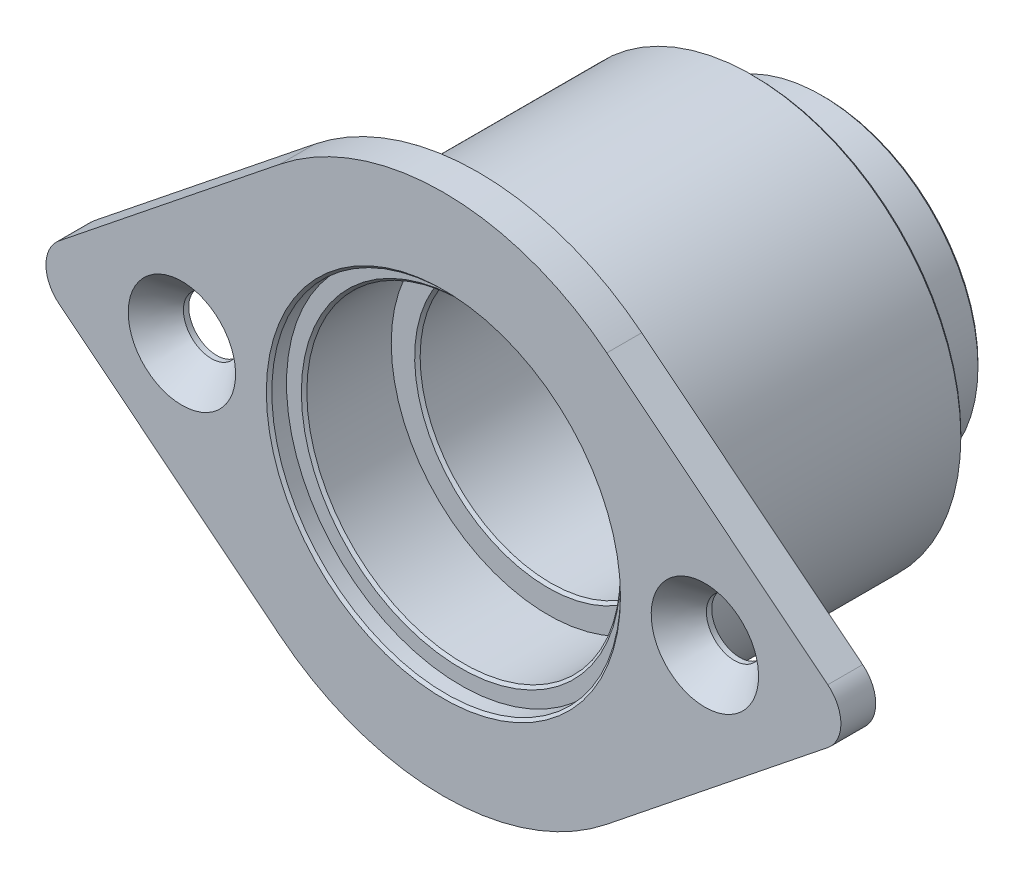
ISO-10303-21;
HEADER;
FILE_DESCRIPTION(('STEP AP214'),'2;1');
FILE_NAME('part.step','',(''),(''),'','','');
FILE_SCHEMA(('AUTOMOTIVE_DESIGN { 1 0 10303 214 1 1 1 1 }'));
ENDSEC;
DATA;
#1=APPLICATION_CONTEXT('core data for automotive mechanical design processes');
#2=APPLICATION_PROTOCOL_DEFINITION('international standard','automotive_design',2000,#1);
#3=PRODUCT_CONTEXT('',#1,'mechanical');
#4=PRODUCT('Part','Part','',(#3));
#5=PRODUCT_RELATED_PRODUCT_CATEGORY('part','',(#4));
#6=PRODUCT_DEFINITION_FORMATION('','',#4);
#7=PRODUCT_DEFINITION_CONTEXT('part definition',#1,'design');
#8=PRODUCT_DEFINITION('design','',#6,#7);
#9=PRODUCT_DEFINITION_SHAPE('','',#8);
#10=(LENGTH_UNIT() NAMED_UNIT(*) SI_UNIT(.MILLI.,.METRE.));
#11=(NAMED_UNIT(*) PLANE_ANGLE_UNIT() SI_UNIT($,.RADIAN.));
#12=(NAMED_UNIT(*) SI_UNIT($,.STERADIAN.) SOLID_ANGLE_UNIT());
#13=UNCERTAINTY_MEASURE_WITH_UNIT(LENGTH_MEASURE(1.E-05),#10,'distance_accuracy_value','');
#14=(GEOMETRIC_REPRESENTATION_CONTEXT(3) GLOBAL_UNCERTAINTY_ASSIGNED_CONTEXT((#13)) GLOBAL_UNIT_ASSIGNED_CONTEXT((#10,
#11,#12)) REPRESENTATION_CONTEXT('',''));
#15=CARTESIAN_POINT('',(0.,0.,0.));
#16=DIRECTION('',(0.,0.,1.));
#17=DIRECTION('',(1.,0.,0.));
#18=AXIS2_PLACEMENT_3D('',#15,#16,#17);
#19=CARTESIAN_POINT('',(0.,0.,-7.9375));
#20=DIRECTION('',(0.,0.,1.));
#21=DIRECTION('',(1.,0.,0.));
#22=AXIS2_PLACEMENT_3D('',#19,#20,#21);
#23=PLANE('',#22);
#24=CARTESIAN_POINT('',(0.,0.,-7.9375));
#25=DIRECTION('',(0.,0.,-1.));
#26=DIRECTION('',(-1.,0.,0.));
#27=AXIS2_PLACEMENT_3D('',#24,#25,#26);
#28=CIRCLE('',#27,14.2748);
#29=CARTESIAN_POINT('',(-14.2748,0.,-7.9375));
#30=VERTEX_POINT('',#29);
#31=EDGE_CURVE('E137',#30,#30,#28,.F.);
#32=ORIENTED_EDGE('',*,*,#31,.T.);
#33=EDGE_LOOP('',(#32));
#34=FACE_BOUND('',#33,.T.);
#35=CARTESIAN_POINT('',(0.,0.,-7.9375));
#36=DIRECTION('',(0.,0.,1.));
#37=DIRECTION('',(0.,-1.,0.));
#38=AXIS2_PLACEMENT_3D('',#35,#36,#37);
#39=CIRCLE('',#38,12.1435499999999);
#40=CARTESIAN_POINT('',(0.,-12.1435499999999,-7.9375));
#41=VERTEX_POINT('',#40);
#42=EDGE_CURVE('E21',#41,#41,#39,.F.);
#43=ORIENTED_EDGE('',*,*,#42,.T.);
#44=EDGE_LOOP('',(#43));
#45=FACE_BOUND('',#44,.T.);
#46=ADVANCED_FACE('F18',(#34,#45),#23,.T.);
#47=CARTESIAN_POINT('',(0.,0.,-7.9375));
#48=DIRECTION('',(0.,0.,1.));
#49=DIRECTION('',(0.,-1.,0.));
#50=AXIS2_PLACEMENT_3D('',#47,#48,#49);
#51=CONICAL_SURFACE('',#50,12.1435499999999,0.785398163397434);
#52=CARTESIAN_POINT('',(0.,0.,-8.18749999999995));
#53=DIRECTION('',(0.,0.,-1.));
#54=DIRECTION('',(-1.,0.,0.));
#55=AXIS2_PLACEMENT_3D('',#52,#53,#54);
#56=CIRCLE('',#55,11.89355);
#57=CARTESIAN_POINT('',(-11.89355,0.,-8.18749999999995));
#58=VERTEX_POINT('',#57);
#59=EDGE_CURVE('E135',#58,#58,#56,.T.);
#60=ORIENTED_EDGE('',*,*,#59,.T.);
#61=EDGE_LOOP('',(#60));
#62=FACE_BOUND('',#61,.T.);
#63=ORIENTED_EDGE('',*,*,#42,.F.);
#64=EDGE_LOOP('',(#63));
#65=FACE_BOUND('',#64,.T.);
#66=ADVANCED_FACE('F196',(#62,#65),#51,.F.);
#67=CARTESIAN_POINT('',(0.,0.,1.5875));
#68=DIRECTION('',(0.,0.,-1.));
#69=DIRECTION('',(-1.,0.,0.));
#70=AXIS2_PLACEMENT_3D('',#67,#68,#69);
#71=CYLINDRICAL_SURFACE('',#70,14.2748);
#72=CARTESIAN_POINT('',(0.,0.,-0.249999999999985));
#73=DIRECTION('',(0.,0.,1.));
#74=DIRECTION('',(1.,0.,0.));
#75=AXIS2_PLACEMENT_3D('',#72,#73,#74);
#76=CIRCLE('',#75,14.2748);
#77=CARTESIAN_POINT('',(14.2748,0.,-0.249999999999985));
#78=VERTEX_POINT('',#77);
#79=EDGE_CURVE('E132',#78,#78,#76,.T.);
#80=ORIENTED_EDGE('',*,*,#79,.T.);
#81=EDGE_LOOP('',(#80));
#82=FACE_BOUND('',#81,.T.);
#83=ORIENTED_EDGE('',*,*,#31,.F.);
#84=EDGE_LOOP('',(#83));
#85=FACE_BOUND('',#84,.T.);
#86=ADVANCED_FACE('F198',(#82,#85),#71,.F.);
#87=CARTESIAN_POINT('',(0.,0.,38.7877315203269));
#88=DIRECTION('',(0.,0.,-1.));
#89=DIRECTION('',(-1.,0.,0.));
#90=AXIS2_PLACEMENT_3D('',#87,#88,#89);
#91=CYLINDRICAL_SURFACE('',#90,11.89355);
#92=ORIENTED_EDGE('',*,*,#59,.F.);
#93=EDGE_LOOP('',(#92));
#94=FACE_BOUND('',#93,.T.);
#95=CARTESIAN_POINT('',(0.,0.,-32.8334999999999));
#96=DIRECTION('',(0.,0.,-1.));
#97=DIRECTION('',(-1.,0.,0.));
#98=AXIS2_PLACEMENT_3D('',#95,#96,#97);
#99=CIRCLE('',#98,11.89355);
#100=CARTESIAN_POINT('',(-11.89355,0.,-32.8334999999999));
#101=VERTEX_POINT('',#100);
#102=EDGE_CURVE('E128',#101,#101,#99,.T.);
#103=ORIENTED_EDGE('',*,*,#102,.T.);
#104=EDGE_LOOP('',(#103));
#105=FACE_BOUND('',#104,.T.);
#106=ADVANCED_FACE('F205',(#94,#105),#91,.F.);
#107=CARTESIAN_POINT('',(0.,0.,0.));
#108=DIRECTION('',(0.,0.,1.));
#109=DIRECTION('',(1.,0.,0.));
#110=AXIS2_PLACEMENT_3D('',#107,#108,#109);
#111=CONICAL_SURFACE('',#110,14.5248,0.785398163397459);
#112=ORIENTED_EDGE('',*,*,#79,.F.);
#113=EDGE_LOOP('',(#112));
#114=FACE_BOUND('',#113,.T.);
#115=CARTESIAN_POINT('',(0.,0.,0.));
#116=DIRECTION('',(0.,0.,1.));
#117=DIRECTION('',(1.,0.,0.));
#118=AXIS2_PLACEMENT_3D('',#115,#116,#117);
#119=CIRCLE('',#118,14.5248);
#120=CARTESIAN_POINT('',(14.5248,0.,0.));
#121=VERTEX_POINT('',#120);
#122=EDGE_CURVE('E131',#121,#121,#119,.F.);
#123=ORIENTED_EDGE('',*,*,#122,.F.);
#124=EDGE_LOOP('',(#123));
#125=FACE_BOUND('',#124,.T.);
#126=ADVANCED_FACE('F301',(#114,#125),#111,.F.);
#127=CARTESIAN_POINT('',(0.,0.,-33.0835));
#128=DIRECTION('',(0.,0.,-1.));
#129=DIRECTION('',(0.,1.,0.));
#130=AXIS2_PLACEMENT_3D('',#127,#128,#129);
#131=CONICAL_SURFACE('',#130,12.1435500000001,0.785398163397448);
#132=ORIENTED_EDGE('',*,*,#102,.F.);
#133=EDGE_LOOP('',(#132));
#134=FACE_BOUND('',#133,.T.);
#135=CARTESIAN_POINT('',(0.,0.,-33.0835));
#136=DIRECTION('',(0.,0.,-1.));
#137=DIRECTION('',(0.,1.,0.));
#138=AXIS2_PLACEMENT_3D('',#135,#136,#137);
#139=CIRCLE('',#138,12.1435500000001);
#140=CARTESIAN_POINT('',(0.,12.1435500000001,-33.0835));
#141=VERTEX_POINT('',#140);
#142=EDGE_CURVE('E185',#141,#141,#139,.F.);
#143=ORIENTED_EDGE('',*,*,#142,.F.);
#144=EDGE_LOOP('',(#143));
#145=FACE_BOUND('',#144,.T.);
#146=ADVANCED_FACE('F297',(#134,#145),#131,.F.);
#147=CARTESIAN_POINT('',(0.,0.,0.));
#148=DIRECTION('',(0.,0.,1.));
#149=DIRECTION('',(1.,0.,0.));
#150=AXIS2_PLACEMENT_3D('',#147,#148,#149);
#151=PLANE('',#150);
#152=CARTESIAN_POINT('',(0.,0.,0.));
#153=DIRECTION('',(0.,0.,1.));
#154=DIRECTION('',(1.,0.,0.));
#155=AXIS2_PLACEMENT_3D('',#152,#153,#154);
#156=CIRCLE('',#155,15.875);
#157=CARTESIAN_POINT('',(15.875,0.,0.));
#158=VERTEX_POINT('',#157);
#159=EDGE_CURVE('E182',#158,#158,#156,.T.);
#160=ORIENTED_EDGE('',*,*,#159,.T.);
#161=EDGE_LOOP('',(#160));
#162=FACE_BOUND('',#161,.T.);
#163=ORIENTED_EDGE('',*,*,#122,.T.);
#164=EDGE_LOOP('',(#163));
#165=FACE_BOUND('',#164,.T.);
#166=ADVANCED_FACE('F293',(#162,#165),#151,.T.);
#167=CARTESIAN_POINT('',(0.,0.,-33.0835));
#168=DIRECTION('',(0.,0.,-1.));
#169=DIRECTION('',(-1.,0.,0.));
#170=AXIS2_PLACEMENT_3D('',#167,#168,#169);
#171=PLANE('',#170);
#172=ORIENTED_EDGE('',*,*,#142,.T.);
#173=EDGE_LOOP('',(#172));
#174=FACE_BOUND('',#173,.T.);
#175=CARTESIAN_POINT('',(0.,0.,-33.0835));
#176=DIRECTION('',(0.,0.,1.));
#177=DIRECTION('',(1.,0.,0.));
#178=AXIS2_PLACEMENT_3D('',#175,#176,#177);
#179=CIRCLE('',#178,14.0121);
#180=CARTESIAN_POINT('',(14.0121,0.,-33.0835));
#181=VERTEX_POINT('',#180);
#182=EDGE_CURVE('E127',#181,#181,#179,.T.);
#183=ORIENTED_EDGE('',*,*,#182,.F.);
#184=EDGE_LOOP('',(#183));
#185=FACE_BOUND('',#184,.T.);
#186=ADVANCED_FACE('F289',(#174,#185),#171,.T.);
#187=CARTESIAN_POINT('',(0.,0.,0.));
#188=DIRECTION('',(0.,0.,1.));
#189=DIRECTION('',(1.,0.,0.));
#190=AXIS2_PLACEMENT_3D('',#187,#188,#189);
#191=CYLINDRICAL_SURFACE('',#190,15.875);
#192=ORIENTED_EDGE('',*,*,#159,.F.);
#193=EDGE_LOOP('',(#192));
#194=FACE_BOUND('',#193,.T.);
#195=CARTESIAN_POINT('',(0.,0.,1.3375));
#196=DIRECTION('',(0.,0.,1.));
#197=DIRECTION('',(1.,0.,0.));
#198=AXIS2_PLACEMENT_3D('',#195,#196,#197);
#199=CIRCLE('',#198,15.875);
#200=CARTESIAN_POINT('',(15.875,0.,1.3375));
#201=VERTEX_POINT('',#200);
#202=EDGE_CURVE('E124',#201,#201,#199,.T.);
#203=ORIENTED_EDGE('',*,*,#202,.T.);
#204=EDGE_LOOP('',(#203));
#205=FACE_BOUND('',#204,.T.);
#206=ADVANCED_FACE('F285',(#194,#205),#191,.F.);
#207=CARTESIAN_POINT('',(0.,0.,-32.8335));
#208=DIRECTION('',(0.,0.,1.));
#209=DIRECTION('',(1.,0.,0.));
#210=AXIS2_PLACEMENT_3D('',#207,#208,#209);
#211=CONICAL_SURFACE('',#210,14.2621,0.785398163397424);
#212=CARTESIAN_POINT('',(0.,0.,-32.8335));
#213=DIRECTION('',(0.,0.,-1.));
#214=DIRECTION('',(-1.,0.,0.));
#215=AXIS2_PLACEMENT_3D('',#212,#213,#214);
#216=CIRCLE('',#215,14.2621);
#217=CARTESIAN_POINT('',(-14.2621,0.,-32.8335));
#218=VERTEX_POINT('',#217);
#219=EDGE_CURVE('E120',#218,#218,#216,.F.);
#220=ORIENTED_EDGE('',*,*,#219,.F.);
#221=EDGE_LOOP('',(#220));
#222=FACE_BOUND('',#221,.T.);
#223=ORIENTED_EDGE('',*,*,#182,.T.);
#224=EDGE_LOOP('',(#223));
#225=FACE_BOUND('',#224,.T.);
#226=ADVANCED_FACE('F281',(#222,#225),#211,.T.);
#227=CARTESIAN_POINT('',(0.,0.,1.5875));
#228=DIRECTION('',(0.,0.,1.));
#229=DIRECTION('',(1.,0.,0.));
#230=AXIS2_PLACEMENT_3D('',#227,#228,#229);
#231=CONICAL_SURFACE('',#230,16.125,0.785398163397476);
#232=ORIENTED_EDGE('',*,*,#202,.F.);
#233=EDGE_LOOP('',(#232));
#234=FACE_BOUND('',#233,.T.);
#235=CARTESIAN_POINT('',(0.,0.,1.5875));
#236=DIRECTION('',(0.,0.,1.));
#237=DIRECTION('',(1.,0.,0.));
#238=AXIS2_PLACEMENT_3D('',#235,#236,#237);
#239=CIRCLE('',#238,16.125);
#240=CARTESIAN_POINT('',(16.125,0.,1.5875));
#241=VERTEX_POINT('',#240);
#242=EDGE_CURVE('E123',#241,#241,#239,.F.);
#243=ORIENTED_EDGE('',*,*,#242,.F.);
#244=EDGE_LOOP('',(#243));
#245=FACE_BOUND('',#244,.T.);
#246=ADVANCED_FACE('F277',(#234,#245),#231,.F.);
#247=CARTESIAN_POINT('',(0.,0.,27.1480367264149));
#248=DIRECTION('',(0.,0.,-1.));
#249=DIRECTION('',(-1.,0.,0.));
#250=AXIS2_PLACEMENT_3D('',#247,#248,#249);
#251=CYLINDRICAL_SURFACE('',#250,14.2621);
#252=ORIENTED_EDGE('',*,*,#219,.T.);
#253=EDGE_LOOP('',(#252));
#254=FACE_BOUND('',#253,.T.);
#255=CARTESIAN_POINT('',(0.,0.,-26.7335));
#256=DIRECTION('',(0.,0.,-1.));
#257=DIRECTION('',(-1.,0.,0.));
#258=AXIS2_PLACEMENT_3D('',#255,#256,#257);
#259=CIRCLE('',#258,14.2621);
#260=CARTESIAN_POINT('',(-14.2621,0.,-26.7335));
#261=VERTEX_POINT('',#260);
#262=EDGE_CURVE('E119',#261,#261,#259,.F.);
#263=ORIENTED_EDGE('',*,*,#262,.F.);
#264=EDGE_LOOP('',(#263));
#265=FACE_BOUND('',#264,.T.);
#266=ADVANCED_FACE('F273',(#254,#265),#251,.T.);
#267=CARTESIAN_POINT('',(-23.8125,0.,1.58749999997099));
#268=DIRECTION('',(0.,0.,1.));
#269=DIRECTION('',(0.,-1.,0.));
#270=AXIS2_PLACEMENT_3D('',#267,#268,#269);
#271=CONICAL_SURFACE('',#270,4.88949999997067,0.71558499333661);
#272=CARTESIAN_POINT('',(-23.8125,0.,-1.10068089399406));
#273=DIRECTION('',(0.,0.,1.));
#274=DIRECTION('',(1.,0.,0.));
#275=AXIS2_PLACEMENT_3D('',#272,#273,#274);
#276=CIRCLE('',#275,2.5527);
#277=CARTESIAN_POINT('',(-21.2598,0.,-1.10068089399406));
#278=VERTEX_POINT('',#277);
#279=EDGE_CURVE('E116',#278,#278,#276,.F.);
#280=ORIENTED_EDGE('',*,*,#279,.T.);
#281=EDGE_LOOP('',(#280));
#282=FACE_BOUND('',#281,.T.);
#283=CARTESIAN_POINT('',(-23.8125,0.,1.58749999997099));
#284=DIRECTION('',(0.,0.,1.));
#285=DIRECTION('',(0.,-1.,0.));
#286=AXIS2_PLACEMENT_3D('',#283,#284,#285);
#287=CIRCLE('',#286,4.88949999997067);
#288=CARTESIAN_POINT('',(-23.8125,-4.88949999997067,1.58749999997099));
#289=VERTEX_POINT('',#288);
#290=EDGE_CURVE('E175',#289,#289,#287,.F.);
#291=ORIENTED_EDGE('',*,*,#290,.F.);
#292=EDGE_LOOP('',(#291));
#293=FACE_BOUND('',#292,.T.);
#294=ADVANCED_FACE('F269',(#282,#293),#271,.F.);
#295=CARTESIAN_POINT('',(23.8125,0.,1.58749999997099));
#296=DIRECTION('',(0.,0.,1.));
#297=DIRECTION('',(0.,-1.,0.));
#298=AXIS2_PLACEMENT_3D('',#295,#296,#297);
#299=CONICAL_SURFACE('',#298,4.88949999995293,0.71558499333661);
#300=CARTESIAN_POINT('',(23.8125,0.,-1.10068089399406));
#301=DIRECTION('',(0.,0.,1.));
#302=DIRECTION('',(1.,0.,0.));
#303=AXIS2_PLACEMENT_3D('',#300,#301,#302);
#304=CIRCLE('',#303,2.5527);
#305=CARTESIAN_POINT('',(26.3652,0.,-1.10068089399406));
#306=VERTEX_POINT('',#305);
#307=EDGE_CURVE('E94',#306,#306,#304,.F.);
#308=ORIENTED_EDGE('',*,*,#307,.T.);
#309=EDGE_LOOP('',(#308));
#310=FACE_BOUND('',#309,.T.);
#311=CARTESIAN_POINT('',(23.8125,0.,1.58749999997099));
#312=DIRECTION('',(0.,0.,1.));
#313=DIRECTION('',(0.,-1.,0.));
#314=AXIS2_PLACEMENT_3D('',#311,#312,#313);
#315=CIRCLE('',#314,4.88949999995293);
#316=CARTESIAN_POINT('',(23.8125,-4.88949999995292,1.58749999997099));
#317=VERTEX_POINT('',#316);
#318=EDGE_CURVE('E172',#317,#317,#315,.F.);
#319=ORIENTED_EDGE('',*,*,#318,.F.);
#320=EDGE_LOOP('',(#319));
#321=FACE_BOUND('',#320,.T.);
#322=ADVANCED_FACE('F266',(#310,#321),#299,.F.);
#323=CARTESIAN_POINT('',(0.,0.,1.5875));
#324=DIRECTION('',(0.,0.,1.));
#325=DIRECTION('',(1.,0.,0.));
#326=AXIS2_PLACEMENT_3D('',#323,#324,#325);
#327=PLANE('',#326);
#328=DIRECTION('',(-0.7806247497998,0.625,0.));
#329=VECTOR('',#328,1.);
#330=CARTESIAN_POINT('',(-14.8828125,-18.5886268546077,1.5875));
#331=LINE('',#330,#329);
#332=CARTESIAN_POINT('',(-35.004375,-2.47848358061436,1.5875));
#333=VERTEX_POINT('',#332);
#334=CARTESIAN_POINT('',(-14.8828125,-18.5886268546077,1.5875));
#335=VERTEX_POINT('',#334);
#336=EDGE_CURVE('E112',#333,#335,#331,.F.);
#337=ORIENTED_EDGE('',*,*,#336,.T.);
#338=CARTESIAN_POINT('',(0.,0.,1.5875));
#339=DIRECTION('',(0.,0.,-1.));
#340=DIRECTION('',(-1.,0.,0.));
#341=AXIS2_PLACEMENT_3D('',#338,#339,#340);
#342=CIRCLE('',#341,23.8125);
#343=CARTESIAN_POINT('',(14.8828125,-18.5886268546077,1.5875));
#344=VERTEX_POINT('',#343);
#345=EDGE_CURVE('E164',#344,#335,#342,.T.);
#346=ORIENTED_EDGE('',*,*,#345,.F.);
#347=DIRECTION('',(0.7806247497998,0.625,0.));
#348=VECTOR('',#347,1.);
#349=CARTESIAN_POINT('',(14.8828125,-18.5886268546077,1.5875));
#350=LINE('',#349,#348);
#351=CARTESIAN_POINT('',(35.004375,-2.47848358061437,1.5875));
#352=VERTEX_POINT('',#351);
#353=EDGE_CURVE('E465',#352,#344,#350,.F.);
#354=ORIENTED_EDGE('',*,*,#353,.F.);
#355=CARTESIAN_POINT('',(33.02,0.,1.5875));
#356=DIRECTION('',(0.,0.,-1.));
#357=DIRECTION('',(-1.,0.,0.));
#358=AXIS2_PLACEMENT_3D('',#355,#356,#357);
#359=CIRCLE('',#358,3.175);
#360=CARTESIAN_POINT('',(35.004375,2.47848358061436,1.5875));
#361=VERTEX_POINT('',#360);
#362=EDGE_CURVE('E159',#361,#352,#359,.T.);
#363=ORIENTED_EDGE('',*,*,#362,.F.);
#364=DIRECTION('',(-0.7806247497998,0.625,0.));
#365=VECTOR('',#364,1.);
#366=CARTESIAN_POINT('',(14.8828125,18.5886268546077,1.5875));
#367=LINE('',#366,#365);
#368=CARTESIAN_POINT('',(14.8828125,18.5886268546077,1.5875));
#369=VERTEX_POINT('',#368);
#370=EDGE_CURVE('E90',#369,#361,#367,.F.);
#371=ORIENTED_EDGE('',*,*,#370,.F.);
#372=CARTESIAN_POINT('',(0.,0.,1.5875));
#373=DIRECTION('',(0.,0.,-1.));
#374=DIRECTION('',(-1.,0.,0.));
#375=AXIS2_PLACEMENT_3D('',#372,#373,#374);
#376=CIRCLE('',#375,23.8125);
#377=CARTESIAN_POINT('',(-14.8828125,18.5886268546077,1.5875));
#378=VERTEX_POINT('',#377);
#379=EDGE_CURVE('E82',#378,#369,#376,.T.);
#380=ORIENTED_EDGE('',*,*,#379,.F.);
#381=DIRECTION('',(0.7806247497998,0.625,0.));
#382=VECTOR('',#381,1.);
#383=CARTESIAN_POINT('',(-14.8828125,18.5886268546077,1.5875));
#384=LINE('',#383,#382);
#385=CARTESIAN_POINT('',(-35.004375,2.47848358061436,1.5875));
#386=VERTEX_POINT('',#385);
#387=EDGE_CURVE('E87',#378,#386,#384,.F.);
#388=ORIENTED_EDGE('',*,*,#387,.T.);
#389=CARTESIAN_POINT('',(-33.02,0.,1.5875));
#390=DIRECTION('',(0.,0.,-1.));
#391=DIRECTION('',(-1.,0.,0.));
#392=AXIS2_PLACEMENT_3D('',#389,#390,#391);
#393=CIRCLE('',#392,3.175);
#394=EDGE_CURVE('E108',#333,#386,#393,.T.);
#395=ORIENTED_EDGE('',*,*,#394,.F.);
#396=EDGE_LOOP('',(#337,#346,#354,#363,#371,#380,#388,#395));
#397=FACE_BOUND('',#396,.T.);
#398=ORIENTED_EDGE('',*,*,#318,.T.);
#399=EDGE_LOOP('',(#398));
#400=FACE_BOUND('',#399,.T.);
#401=ORIENTED_EDGE('',*,*,#290,.T.);
#402=EDGE_LOOP('',(#401));
#403=FACE_BOUND('',#402,.T.);
#404=ORIENTED_EDGE('',*,*,#242,.T.);
#405=EDGE_LOOP('',(#404));
#406=FACE_BOUND('',#405,.T.);
#407=ADVANCED_FACE('F84',(#397,#400,#403,#406),#327,.T.);
#408=CARTESIAN_POINT('',(0.,0.,-26.7335));
#409=DIRECTION('',(0.,0.,-1.));
#410=DIRECTION('',(-1.,0.,0.));
#411=AXIS2_PLACEMENT_3D('',#408,#409,#410);
#412=PLANE('',#411);
#413=ORIENTED_EDGE('',*,*,#262,.T.);
#414=EDGE_LOOP('',(#413));
#415=FACE_BOUND('',#414,.T.);
#416=CARTESIAN_POINT('',(0.,0.,-26.7335));
#417=DIRECTION('',(0.,0.,1.));
#418=DIRECTION('',(1.,0.,0.));
#419=AXIS2_PLACEMENT_3D('',#416,#417,#418);
#420=CIRCLE('',#419,18.8);
#421=CARTESIAN_POINT('',(18.8,0.,-26.7335));
#422=VERTEX_POINT('',#421);
#423=EDGE_CURVE('E155',#422,#422,#420,.T.);
#424=ORIENTED_EDGE('',*,*,#423,.F.);
#425=EDGE_LOOP('',(#424));
#426=FACE_BOUND('',#425,.T.);
#427=ADVANCED_FACE('F259',(#415,#426),#412,.T.);
#428=CARTESIAN_POINT('',(-23.8125,0.,1.5875));
#429=DIRECTION('',(0.,0.,1.));
#430=DIRECTION('',(1.,0.,0.));
#431=AXIS2_PLACEMENT_3D('',#428,#429,#430);
#432=CYLINDRICAL_SURFACE('',#431,2.5527);
#433=CARTESIAN_POINT('',(-23.8125,0.,-1.5875));
#434=DIRECTION('',(0.,0.,1.));
#435=DIRECTION('',(1.,0.,0.));
#436=AXIS2_PLACEMENT_3D('',#433,#434,#435);
#437=CIRCLE('',#436,2.5527);
#438=CARTESIAN_POINT('',(-21.2598,0.,-1.5875));
#439=VERTEX_POINT('',#438);
#440=EDGE_CURVE('E152',#439,#439,#437,.F.);
#441=ORIENTED_EDGE('',*,*,#440,.T.);
#442=EDGE_LOOP('',(#441));
#443=FACE_BOUND('',#442,.T.);
#444=ORIENTED_EDGE('',*,*,#279,.F.);
#445=EDGE_LOOP('',(#444));
#446=FACE_BOUND('',#445,.T.);
#447=ADVANCED_FACE('F255',(#443,#446),#432,.F.);
#448=CARTESIAN_POINT('',(23.8125,0.,1.5875));
#449=DIRECTION('',(0.,0.,1.));
#450=DIRECTION('',(1.,0.,0.));
#451=AXIS2_PLACEMENT_3D('',#448,#449,#450);
#452=CYLINDRICAL_SURFACE('',#451,2.5527);
#453=CARTESIAN_POINT('',(23.8125,0.,-1.5875));
#454=DIRECTION('',(0.,0.,1.));
#455=DIRECTION('',(1.,0.,0.));
#456=AXIS2_PLACEMENT_3D('',#453,#454,#455);
#457=CIRCLE('',#456,2.5527);
#458=CARTESIAN_POINT('',(26.3652,0.,-1.5875));
#459=VERTEX_POINT('',#458);
#460=EDGE_CURVE('E149',#459,#459,#457,.F.);
#461=ORIENTED_EDGE('',*,*,#460,.T.);
#462=EDGE_LOOP('',(#461));
#463=FACE_BOUND('',#462,.T.);
#464=ORIENTED_EDGE('',*,*,#307,.F.);
#465=EDGE_LOOP('',(#464));
#466=FACE_BOUND('',#465,.T.);
#467=ADVANCED_FACE('F252',(#463,#466),#452,.F.);
#468=CARTESIAN_POINT('',(0.,0.,1.5875));
#469=DIRECTION('',(0.,0.,-1.));
#470=DIRECTION('',(-1.,0.,0.));
#471=AXIS2_PLACEMENT_3D('',#468,#469,#470);
#472=CYLINDRICAL_SURFACE('',#471,23.8125);
#473=ORIENTED_EDGE('',*,*,#379,.T.);
#474=DIRECTION('',(0.,0.,1.));
#475=VECTOR('',#474,1.);
#476=CARTESIAN_POINT('',(14.8828125,18.5886268546077,1.5875));
#477=LINE('',#476,#475);
#478=CARTESIAN_POINT('',(14.8828125,18.5886268546077,-1.5875));
#479=VERTEX_POINT('',#478);
#480=EDGE_CURVE('E158',#479,#369,#477,.T.);
#481=ORIENTED_EDGE('',*,*,#480,.F.);
#482=CARTESIAN_POINT('',(0.,0.,-1.5875));
#483=DIRECTION('',(0.,0.,-1.));
#484=DIRECTION('',(-1.,0.,0.));
#485=AXIS2_PLACEMENT_3D('',#482,#483,#484);
#486=CIRCLE('',#485,23.8125);
#487=CARTESIAN_POINT('',(-14.8828125,18.5886268546077,-1.5875));
#488=VERTEX_POINT('',#487);
#489=EDGE_CURVE('E99',#479,#488,#486,.F.);
#490=ORIENTED_EDGE('',*,*,#489,.T.);
#491=DIRECTION('',(0.,0.,1.));
#492=VECTOR('',#491,1.);
#493=CARTESIAN_POINT('',(-14.8828125,18.5886268546077,1.5875));
#494=LINE('',#493,#492);
#495=EDGE_CURVE('E93',#488,#378,#494,.T.);
#496=ORIENTED_EDGE('',*,*,#495,.T.);
#497=EDGE_LOOP('',(#473,#481,#490,#496));
#498=FACE_BOUND('',#497,.T.);
#499=ADVANCED_FACE('F97',(#498),#472,.T.);
#500=CARTESIAN_POINT('',(-14.8828125,18.5886268546077,1.5875));
#501=DIRECTION('',(0.625,-0.7806247497998,0.));
#502=DIRECTION('',(0.7806247497998,0.625,0.));
#503=AXIS2_PLACEMENT_3D('',#500,#501,#502);
#504=PLANE('',#503);
#505=DIRECTION('',(0.,0.,-1.));
#506=VECTOR('',#505,1.);
#507=CARTESIAN_POINT('',(-35.004375,2.47848358061435,1.5875));
#508=LINE('',#507,#506);
#509=CARTESIAN_POINT('',(-35.004375,2.47848358061436,-1.5875));
#510=VERTEX_POINT('',#509);
#511=EDGE_CURVE('E106',#386,#510,#508,.T.);
#512=ORIENTED_EDGE('',*,*,#511,.F.);
#513=ORIENTED_EDGE('',*,*,#387,.F.);
#514=ORIENTED_EDGE('',*,*,#495,.F.);
#515=DIRECTION('',(-0.7806247497998,-0.625,0.));
#516=VECTOR('',#515,1.);
#517=CARTESIAN_POINT('',(-14.8828125,18.5886268546077,-1.5875));
#518=LINE('',#517,#516);
#519=EDGE_CURVE('E147',#488,#510,#518,.T.);
#520=ORIENTED_EDGE('',*,*,#519,.T.);
#521=EDGE_LOOP('',(#512,#513,#514,#520));
#522=FACE_BOUND('',#521,.T.);
#523=ADVANCED_FACE('F104',(#522),#504,.F.);
#524=CARTESIAN_POINT('',(-33.02,0.,1.5875));
#525=DIRECTION('',(0.,0.,-1.));
#526=DIRECTION('',(-1.,0.,0.));
#527=AXIS2_PLACEMENT_3D('',#524,#525,#526);
#528=CYLINDRICAL_SURFACE('',#527,3.175);
#529=CARTESIAN_POINT('',(-33.02,0.,-1.5875));
#530=DIRECTION('',(0.,0.,-1.));
#531=DIRECTION('',(-1.,0.,0.));
#532=AXIS2_PLACEMENT_3D('',#529,#530,#531);
#533=CIRCLE('',#532,3.175);
#534=CARTESIAN_POINT('',(-35.004375,-2.47848358061437,-1.5875));
#535=VERTEX_POINT('',#534);
#536=EDGE_CURVE('E145',#510,#535,#533,.F.);
#537=ORIENTED_EDGE('',*,*,#536,.T.);
#538=DIRECTION('',(0.,0.,1.));
#539=VECTOR('',#538,1.);
#540=CARTESIAN_POINT('',(-35.004375,-2.47848358061437,1.5875));
#541=LINE('',#540,#539);
#542=EDGE_CURVE('E168',#535,#333,#541,.T.);
#543=ORIENTED_EDGE('',*,*,#542,.T.);
#544=ORIENTED_EDGE('',*,*,#394,.T.);
#545=ORIENTED_EDGE('',*,*,#511,.T.);
#546=EDGE_LOOP('',(#537,#543,#544,#545));
#547=FACE_BOUND('',#546,.T.);
#548=ADVANCED_FACE('F243',(#547),#528,.T.);
#549=CARTESIAN_POINT('',(-14.8828125,-18.5886268546077,1.5875));
#550=DIRECTION('',(0.625,0.7806247497998,0.));
#551=DIRECTION('',(-0.7806247497998,0.625,0.));
#552=AXIS2_PLACEMENT_3D('',#549,#550,#551);
#553=PLANE('',#552);
#554=ORIENTED_EDGE('',*,*,#542,.F.);
#555=DIRECTION('',(0.7806247497998,-0.625,0.));
#556=VECTOR('',#555,1.);
#557=CARTESIAN_POINT('',(-35.004375,-2.47848358061437,-1.5875));
#558=LINE('',#557,#556);
#559=CARTESIAN_POINT('',(-14.8828125,-18.5886268546077,-1.5875));
#560=VERTEX_POINT('',#559);
#561=EDGE_CURVE('E144',#535,#560,#558,.T.);
#562=ORIENTED_EDGE('',*,*,#561,.T.);
#563=DIRECTION('',(0.,0.,-1.));
#564=VECTOR('',#563,1.);
#565=CARTESIAN_POINT('',(-14.8828125,-18.5886268546077,1.5875));
#566=LINE('',#565,#564);
#567=EDGE_CURVE('E167',#335,#560,#566,.T.);
#568=ORIENTED_EDGE('',*,*,#567,.F.);
#569=ORIENTED_EDGE('',*,*,#336,.F.);
#570=EDGE_LOOP('',(#554,#562,#568,#569));
#571=FACE_BOUND('',#570,.T.);
#572=ADVANCED_FACE('F239',(#571),#553,.F.);
#573=CARTESIAN_POINT('',(0.,0.,1.5875));
#574=DIRECTION('',(0.,0.,-1.));
#575=DIRECTION('',(-1.,0.,0.));
#576=AXIS2_PLACEMENT_3D('',#573,#574,#575);
#577=CYLINDRICAL_SURFACE('',#576,23.8125);
#578=ORIENTED_EDGE('',*,*,#345,.T.);
#579=ORIENTED_EDGE('',*,*,#567,.T.);
#580=CARTESIAN_POINT('',(0.,0.,-1.5875));
#581=DIRECTION('',(0.,0.,-1.));
#582=DIRECTION('',(-1.,0.,0.));
#583=AXIS2_PLACEMENT_3D('',#580,#581,#582);
#584=CIRCLE('',#583,23.8125);
#585=CARTESIAN_POINT('',(14.8828125,-18.5886268546077,-1.5875));
#586=VERTEX_POINT('',#585);
#587=EDGE_CURVE('E142',#560,#586,#584,.F.);
#588=ORIENTED_EDGE('',*,*,#587,.T.);
#589=DIRECTION('',(0.,0.,1.));
#590=VECTOR('',#589,1.);
#591=CARTESIAN_POINT('',(14.8828125,-18.5886268546077,1.5875));
#592=LINE('',#591,#590);
#593=EDGE_CURVE('E163',#344,#586,#592,.F.);
#594=ORIENTED_EDGE('',*,*,#593,.F.);
#595=EDGE_LOOP('',(#578,#579,#588,#594));
#596=FACE_BOUND('',#595,.T.);
#597=ADVANCED_FACE('F235',(#596),#577,.T.);
#598=CARTESIAN_POINT('',(14.8828125,-18.5886268546077,1.5875));
#599=DIRECTION('',(0.625,-0.7806247497998,0.));
#600=DIRECTION('',(0.7806247497998,0.625,0.));
#601=AXIS2_PLACEMENT_3D('',#598,#599,#600);
#602=PLANE('',#601);
#603=ORIENTED_EDGE('',*,*,#353,.T.);
#604=ORIENTED_EDGE('',*,*,#593,.T.);
#605=DIRECTION('',(0.7806247497998,0.625,0.));
#606=VECTOR('',#605,1.);
#607=CARTESIAN_POINT('',(14.8828125,-18.5886268546077,-1.5875));
#608=LINE('',#607,#606);
#609=CARTESIAN_POINT('',(35.004375,-2.47848358061437,-1.5875));
#610=VERTEX_POINT('',#609);
#611=EDGE_CURVE('E141',#586,#610,#608,.T.);
#612=ORIENTED_EDGE('',*,*,#611,.T.);
#613=DIRECTION('',(0.,0.,-1.));
#614=VECTOR('',#613,1.);
#615=CARTESIAN_POINT('',(35.004375,-2.47848358061437,1.5875));
#616=LINE('',#615,#614);
#617=EDGE_CURVE('E162',#352,#610,#616,.T.);
#618=ORIENTED_EDGE('',*,*,#617,.F.);
#619=EDGE_LOOP('',(#603,#604,#612,#618));
#620=FACE_BOUND('',#619,.T.);
#621=ADVANCED_FACE('F232',(#620),#602,.T.);
#622=CARTESIAN_POINT('',(33.02,0.,1.5875));
#623=DIRECTION('',(0.,0.,-1.));
#624=DIRECTION('',(-1.,0.,0.));
#625=AXIS2_PLACEMENT_3D('',#622,#623,#624);
#626=CYLINDRICAL_SURFACE('',#625,3.175);
#627=CARTESIAN_POINT('',(33.02,0.,-1.5875));
#628=DIRECTION('',(0.,0.,-1.));
#629=DIRECTION('',(-1.,0.,0.));
#630=AXIS2_PLACEMENT_3D('',#627,#628,#629);
#631=CIRCLE('',#630,3.175);
#632=CARTESIAN_POINT('',(35.004375,2.47848358061436,-1.5875));
#633=VERTEX_POINT('',#632);
#634=EDGE_CURVE('E36',#610,#633,#631,.F.);
#635=ORIENTED_EDGE('',*,*,#634,.T.);
#636=DIRECTION('',(0.,0.,1.));
#637=VECTOR('',#636,1.);
#638=CARTESIAN_POINT('',(35.004375,2.47848358061436,1.5875));
#639=LINE('',#638,#637);
#640=EDGE_CURVE('E459',#361,#633,#639,.F.);
#641=ORIENTED_EDGE('',*,*,#640,.F.);
#642=ORIENTED_EDGE('',*,*,#362,.T.);
#643=ORIENTED_EDGE('',*,*,#617,.T.);
#644=EDGE_LOOP('',(#635,#641,#642,#643));
#645=FACE_BOUND('',#644,.T.);
#646=ADVANCED_FACE('F228',(#645),#626,.T.);
#647=CARTESIAN_POINT('',(14.8828125,18.5886268546077,1.5875));
#648=DIRECTION('',(0.625,0.7806247497998,0.));
#649=DIRECTION('',(-0.7806247497998,0.625,0.));
#650=AXIS2_PLACEMENT_3D('',#647,#648,#649);
#651=PLANE('',#650);
#652=DIRECTION('',(-0.7806247497998,0.625,0.));
#653=VECTOR('',#652,1.);
#654=CARTESIAN_POINT('',(35.004375,2.47848358061437,-1.5875));
#655=LINE('',#654,#653);
#656=EDGE_CURVE('E140',#633,#479,#655,.T.);
#657=ORIENTED_EDGE('',*,*,#656,.T.);
#658=ORIENTED_EDGE('',*,*,#480,.T.);
#659=ORIENTED_EDGE('',*,*,#370,.T.);
#660=ORIENTED_EDGE('',*,*,#640,.T.);
#661=EDGE_LOOP('',(#657,#658,#659,#660));
#662=FACE_BOUND('',#661,.T.);
#663=ADVANCED_FACE('F224',(#662),#651,.T.);
#664=CARTESIAN_POINT('',(0.,0.,-26.4835));
#665=DIRECTION('',(0.,0.,1.));
#666=DIRECTION('',(1.,0.,0.));
#667=AXIS2_PLACEMENT_3D('',#664,#665,#666);
#668=CONICAL_SURFACE('',#667,19.05,0.785398163397434);
#669=ORIENTED_EDGE('',*,*,#423,.T.);
#670=EDGE_LOOP('',(#669));
#671=FACE_BOUND('',#670,.T.);
#672=CARTESIAN_POINT('',(0.,0.,-26.4835));
#673=DIRECTION('',(0.,0.,1.));
#674=DIRECTION('',(1.,0.,0.));
#675=AXIS2_PLACEMENT_3D('',#672,#673,#674);
#676=CIRCLE('',#675,19.05);
#677=CARTESIAN_POINT('',(19.05,0.,-26.4835));
#678=VERTEX_POINT('',#677);
#679=EDGE_CURVE('E27',#678,#678,#676,.T.);
#680=ORIENTED_EDGE('',*,*,#679,.F.);
#681=EDGE_LOOP('',(#680));
#682=FACE_BOUND('',#681,.T.);
#683=ADVANCED_FACE('F216',(#671,#682),#668,.T.);
#684=CARTESIAN_POINT('',(0.,0.,-1.5875));
#685=DIRECTION('',(0.,0.,1.));
#686=DIRECTION('',(1.,0.,0.));
#687=AXIS2_PLACEMENT_3D('',#684,#685,#686);
#688=PLANE('',#687);
#689=CARTESIAN_POINT('',(0.,0.,-1.5875));
#690=DIRECTION('',(0.,0.,1.));
#691=DIRECTION('',(1.,0.,0.));
#692=AXIS2_PLACEMENT_3D('',#689,#690,#691);
#693=CIRCLE('',#692,19.05);
#694=CARTESIAN_POINT('',(19.05,0.,-1.5875));
#695=VERTEX_POINT('',#694);
#696=EDGE_CURVE('E11',#695,#695,#693,.F.);
#697=ORIENTED_EDGE('',*,*,#696,.F.);
#698=EDGE_LOOP('',(#697));
#699=FACE_BOUND('',#698,.T.);
#700=ORIENTED_EDGE('',*,*,#634,.F.);
#701=ORIENTED_EDGE('',*,*,#611,.F.);
#702=ORIENTED_EDGE('',*,*,#587,.F.);
#703=ORIENTED_EDGE('',*,*,#561,.F.);
#704=ORIENTED_EDGE('',*,*,#536,.F.);
#705=ORIENTED_EDGE('',*,*,#519,.F.);
#706=ORIENTED_EDGE('',*,*,#489,.F.);
#707=ORIENTED_EDGE('',*,*,#656,.F.);
#708=EDGE_LOOP('',(#700,#701,#702,#703,#704,#705,#706,#707));
#709=FACE_BOUND('',#708,.T.);
#710=ORIENTED_EDGE('',*,*,#460,.F.);
#711=EDGE_LOOP('',(#710));
#712=FACE_BOUND('',#711,.T.);
#713=ORIENTED_EDGE('',*,*,#440,.F.);
#714=EDGE_LOOP('',(#713));
#715=FACE_BOUND('',#714,.T.);
#716=ADVANCED_FACE('F210',(#699,#709,#712,#715),#688,.F.);
#717=CARTESIAN_POINT('',(0.,0.,-26.7335));
#718=DIRECTION('',(0.,0.,1.));
#719=DIRECTION('',(1.,0.,0.));
#720=AXIS2_PLACEMENT_3D('',#717,#718,#719);
#721=CYLINDRICAL_SURFACE('',#720,19.05);
#722=ORIENTED_EDGE('',*,*,#679,.T.);
#723=EDGE_LOOP('',(#722));
#724=FACE_BOUND('',#723,.T.);
#725=ORIENTED_EDGE('',*,*,#696,.T.);
#726=EDGE_LOOP('',(#725));
#727=FACE_BOUND('',#726,.T.);
#728=ADVANCED_FACE('F208',(#724,#727),#721,.T.);
#729=CLOSED_SHELL('',(#46,#66,#86,#106,#126,#146,#166,#186,#206,#226,#246,#266,#294,#322,#407,
#427,#447,#467,#499,#523,#548,#572,#597,#621,#646,#663,#683,#716,#728));
#730=MANIFOLD_SOLID_BREP('B1',#729);
#731=ADVANCED_BREP_SHAPE_REPRESENTATION('',(#18,#730),#14);
#732=SHAPE_DEFINITION_REPRESENTATION(#9,#731);
ENDSEC;
END-ISO-10303-21;
